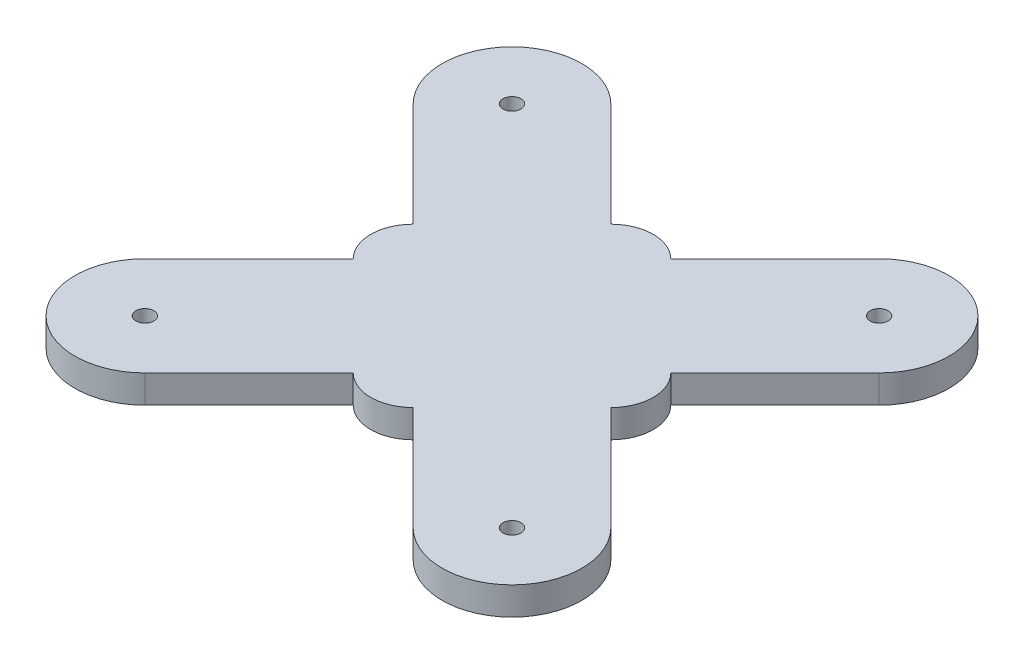
ISO-10303-21;
HEADER;
FILE_DESCRIPTION(('STEP AP214'),'2;1');
FILE_NAME('part.step','',(''),(''),'','','');
FILE_SCHEMA(('AUTOMOTIVE_DESIGN { 1 0 10303 214 1 1 1 1 }'));
ENDSEC;
DATA;
#1=APPLICATION_CONTEXT('core data for automotive mechanical design processes');
#2=APPLICATION_PROTOCOL_DEFINITION('international standard','automotive_design',2000,#1);
#3=PRODUCT_CONTEXT('',#1,'mechanical');
#4=PRODUCT('Part','Part','',(#3));
#5=PRODUCT_RELATED_PRODUCT_CATEGORY('part','',(#4));
#6=PRODUCT_DEFINITION_FORMATION('','',#4);
#7=PRODUCT_DEFINITION_CONTEXT('part definition',#1,'design');
#8=PRODUCT_DEFINITION('design','',#6,#7);
#9=PRODUCT_DEFINITION_SHAPE('','',#8);
#10=(LENGTH_UNIT() NAMED_UNIT(*) SI_UNIT(.MILLI.,.METRE.));
#11=(NAMED_UNIT(*) PLANE_ANGLE_UNIT() SI_UNIT($,.RADIAN.));
#12=(NAMED_UNIT(*) SI_UNIT($,.STERADIAN.) SOLID_ANGLE_UNIT());
#13=UNCERTAINTY_MEASURE_WITH_UNIT(LENGTH_MEASURE(1.E-05),#10,'distance_accuracy_value','');
#14=(GEOMETRIC_REPRESENTATION_CONTEXT(3) GLOBAL_UNCERTAINTY_ASSIGNED_CONTEXT((#13)) GLOBAL_UNIT_ASSIGNED_CONTEXT((#10,
#11,#12)) REPRESENTATION_CONTEXT('',''));
#15=CARTESIAN_POINT('',(0.,0.,0.));
#16=DIRECTION('',(0.,0.,1.));
#17=DIRECTION('',(1.,0.,0.));
#18=AXIS2_PLACEMENT_3D('',#15,#16,#17);
#19=CARTESIAN_POINT('',(-65.654864633171,10.,-65.654864633171));
#20=DIRECTION('',(0.,1.,0.));
#21=DIRECTION('',(0.,0.,1.));
#22=AXIS2_PLACEMENT_3D('',#19,#20,#21);
#23=PLANE('',#22);
#24=CARTESIAN_POINT('',(65.654864633171,10.,-65.654864633171));
#25=DIRECTION('',(0.,1.,0.));
#26=DIRECTION('',(0.,0.,1.));
#27=AXIS2_PLACEMENT_3D('',#24,#25,#26);
#28=CIRCLE('',#27,3.19999999999999);
#29=CARTESIAN_POINT('',(65.654864633171,10.,-62.454864633171));
#30=VERTEX_POINT('',#29);
#31=EDGE_CURVE('E344',#30,#30,#28,.T.);
#32=ORIENTED_EDGE('',*,*,#31,.F.);
#33=EDGE_LOOP('',(#32));
#34=FACE_BOUND('',#33,.T.);
#35=CARTESIAN_POINT('',(-65.654864633171,10.,-65.654864633171));
#36=DIRECTION('',(0.,1.,0.));
#37=DIRECTION('',(0.,0.,1.));
#38=AXIS2_PLACEMENT_3D('',#35,#36,#37);
#39=CIRCLE('',#38,3.19999999999999);
#40=CARTESIAN_POINT('',(-65.654864633171,10.,-62.454864633171));
#41=VERTEX_POINT('',#40);
#42=EDGE_CURVE('E182',#41,#41,#39,.T.);
#43=ORIENTED_EDGE('',*,*,#42,.F.);
#44=EDGE_LOOP('',(#43));
#45=FACE_BOUND('',#44,.T.);
#46=CARTESIAN_POINT('',(-65.654864633171,10.,-65.654864633171));
#47=DIRECTION('',(0.,1.,0.));
#48=DIRECTION('',(0.,0.,1.));
#49=AXIS2_PLACEMENT_3D('',#46,#47,#48);
#50=CIRCLE('',#49,25.);
#51=CARTESIAN_POINT('',(-47.9771951035073,10.,-83.3325341628346));
#52=VERTEX_POINT('',#51);
#53=CARTESIAN_POINT('',(-83.3325341628346,10.,-47.9771951035073));
#54=VERTEX_POINT('',#53);
#55=EDGE_CURVE('E209',#52,#54,#50,.T.);
#56=ORIENTED_EDGE('',*,*,#55,.T.);
#57=DIRECTION('',(0.707106781186547,0.,0.707106781186548));
#58=VECTOR('',#57,1.);
#59=CARTESIAN_POINT('',(-83.3325341628346,10.,-47.9771951035073));
#60=LINE('',#59,#58);
#61=CARTESIAN_POINT('',(-46.0745224218814,10.,-10.7191833625541));
#62=VERTEX_POINT('',#61);
#63=EDGE_CURVE('E117',#54,#62,#60,.T.);
#64=ORIENTED_EDGE('',*,*,#63,.T.);
#65=CARTESIAN_POINT('',(-35.3553390593273,10.,0.));
#66=DIRECTION('',(0.,1.,0.));
#67=DIRECTION('',(0.,0.,1.));
#68=AXIS2_PLACEMENT_3D('',#65,#66,#67);
#69=CIRCLE('',#68,15.159214488888);
#70=CARTESIAN_POINT('',(-46.0745224218814,10.,10.7191833625541));
#71=VERTEX_POINT('',#70);
#72=EDGE_CURVE('E248',#62,#71,#69,.T.);
#73=ORIENTED_EDGE('',*,*,#72,.T.);
#74=DIRECTION('',(-0.707106781186547,0.,0.707106781186547));
#75=VECTOR('',#74,1.);
#76=CARTESIAN_POINT('',(-83.3325341628347,10.,47.9771951035073));
#77=LINE('',#76,#75);
#78=CARTESIAN_POINT('',(-83.3325341628347,10.,47.9771951035073));
#79=VERTEX_POINT('',#78);
#80=EDGE_CURVE('E267',#71,#79,#77,.T.);
#81=ORIENTED_EDGE('',*,*,#80,.T.);
#82=CARTESIAN_POINT('',(-65.654864633171,10.,65.654864633171));
#83=DIRECTION('',(0.,1.,0.));
#84=DIRECTION('',(0.,0.,1.));
#85=AXIS2_PLACEMENT_3D('',#82,#83,#84);
#86=CIRCLE('',#85,25.);
#87=CARTESIAN_POINT('',(-47.9771951035073,10.,83.3325341628347));
#88=VERTEX_POINT('',#87);
#89=EDGE_CURVE('E264',#79,#88,#86,.T.);
#90=ORIENTED_EDGE('',*,*,#89,.T.);
#91=DIRECTION('',(0.707106781186548,0.,-0.707106781186547));
#92=VECTOR('',#91,1.);
#93=CARTESIAN_POINT('',(-47.9771951035073,10.,83.3325341628347));
#94=LINE('',#93,#92);
#95=CARTESIAN_POINT('',(-10.719183362554,10.,46.0745224218814));
#96=VERTEX_POINT('',#95);
#97=EDGE_CURVE('E266',#88,#96,#94,.T.);
#98=ORIENTED_EDGE('',*,*,#97,.T.);
#99=CARTESIAN_POINT('',(0.,10.,35.3553390593274));
#100=DIRECTION('',(0.,1.,0.));
#101=DIRECTION('',(0.,0.,1.));
#102=AXIS2_PLACEMENT_3D('',#99,#100,#101);
#103=CIRCLE('',#102,15.159214488888);
#104=CARTESIAN_POINT('',(10.7191833625541,10.,46.0745224218814));
#105=VERTEX_POINT('',#104);
#106=EDGE_CURVE('E269',#96,#105,#103,.T.);
#107=ORIENTED_EDGE('',*,*,#106,.T.);
#108=DIRECTION('',(0.707106781186548,0.,0.707106781186547));
#109=VECTOR('',#108,1.);
#110=CARTESIAN_POINT('',(10.7191833625541,10.,46.0745224218814));
#111=LINE('',#110,#109);
#112=CARTESIAN_POINT('',(47.9771951035073,10.,83.3325341628346));
#113=VERTEX_POINT('',#112);
#114=EDGE_CURVE('E275',#105,#113,#111,.T.);
#115=ORIENTED_EDGE('',*,*,#114,.T.);
#116=CARTESIAN_POINT('',(65.654864633171,10.,65.654864633171));
#117=DIRECTION('',(0.,1.,0.));
#118=DIRECTION('',(0.,0.,1.));
#119=AXIS2_PLACEMENT_3D('',#116,#117,#118);
#120=CIRCLE('',#119,25.);
#121=CARTESIAN_POINT('',(83.3325341628346,10.,47.9771951035073));
#122=VERTEX_POINT('',#121);
#123=EDGE_CURVE('E277',#113,#122,#120,.T.);
#124=ORIENTED_EDGE('',*,*,#123,.T.);
#125=DIRECTION('',(-0.707106781186547,0.,-0.707106781186548));
#126=VECTOR('',#125,1.);
#127=CARTESIAN_POINT('',(46.0745224218814,10.,10.719183362554));
#128=LINE('',#127,#126);
#129=CARTESIAN_POINT('',(46.0745224218814,10.,10.719183362554));
#130=VERTEX_POINT('',#129);
#131=EDGE_CURVE('E279',#122,#130,#128,.T.);
#132=ORIENTED_EDGE('',*,*,#131,.T.);
#133=CARTESIAN_POINT('',(35.3553390593274,10.,0.));
#134=DIRECTION('',(0.,1.,0.));
#135=DIRECTION('',(0.,0.,1.));
#136=AXIS2_PLACEMENT_3D('',#133,#134,#135);
#137=CIRCLE('',#136,15.159214488888);
#138=CARTESIAN_POINT('',(46.0745224218814,10.,-10.719183362554));
#139=VERTEX_POINT('',#138);
#140=EDGE_CURVE('E281',#130,#139,#137,.T.);
#141=ORIENTED_EDGE('',*,*,#140,.T.);
#142=DIRECTION('',(0.707106781186548,0.,-0.707106781186547));
#143=VECTOR('',#142,1.);
#144=CARTESIAN_POINT('',(46.0745224218814,10.,-10.719183362554));
#145=LINE('',#144,#143);
#146=CARTESIAN_POINT('',(83.3325341628347,10.,-47.9771951035073));
#147=VERTEX_POINT('',#146);
#148=EDGE_CURVE('E283',#139,#147,#145,.T.);
#149=ORIENTED_EDGE('',*,*,#148,.T.);
#150=CARTESIAN_POINT('',(65.654864633171,10.,-65.654864633171));
#151=DIRECTION('',(0.,1.,0.));
#152=DIRECTION('',(0.,0.,1.));
#153=AXIS2_PLACEMENT_3D('',#150,#151,#152);
#154=CIRCLE('',#153,25.);
#155=CARTESIAN_POINT('',(47.9771951035073,10.,-83.3325341628347));
#156=VERTEX_POINT('',#155);
#157=EDGE_CURVE('E160',#147,#156,#154,.T.);
#158=ORIENTED_EDGE('',*,*,#157,.T.);
#159=DIRECTION('',(-0.707106781186548,0.,0.707106781186547));
#160=VECTOR('',#159,1.);
#161=CARTESIAN_POINT('',(10.719183362554,10.,-46.0745224218814));
#162=LINE('',#161,#160);
#163=CARTESIAN_POINT('',(10.719183362554,10.,-46.0745224218814));
#164=VERTEX_POINT('',#163);
#165=EDGE_CURVE('E154',#156,#164,#162,.T.);
#166=ORIENTED_EDGE('',*,*,#165,.T.);
#167=CARTESIAN_POINT('',(0.,10.,-35.3553390593274));
#168=DIRECTION('',(0.,1.,0.));
#169=DIRECTION('',(0.,0.,1.));
#170=AXIS2_PLACEMENT_3D('',#167,#168,#169);
#171=CIRCLE('',#170,15.159214488888);
#172=CARTESIAN_POINT('',(-10.7191833625541,10.,-46.0745224218814));
#173=VERTEX_POINT('',#172);
#174=EDGE_CURVE('E158',#164,#173,#171,.T.);
#175=ORIENTED_EDGE('',*,*,#174,.T.);
#176=DIRECTION('',(-0.707106781186548,0.,-0.707106781186547));
#177=VECTOR('',#176,1.);
#178=CARTESIAN_POINT('',(-47.9771951035073,10.,-83.3325341628346));
#179=LINE('',#178,#177);
#180=EDGE_CURVE('E50',#173,#52,#179,.T.);
#181=ORIENTED_EDGE('',*,*,#180,.T.);
#182=EDGE_LOOP('',(#56,#64,#73,#81,#90,#98,#107,#115,#124,#132,#141,#149,#158,#166,#175,#181));
#183=FACE_BOUND('',#182,.T.);
#184=CARTESIAN_POINT('',(65.654864633171,10.,65.654864633171));
#185=DIRECTION('',(0.,1.,0.));
#186=DIRECTION('',(0.,0.,-1.));
#187=AXIS2_PLACEMENT_3D('',#184,#185,#186);
#188=CIRCLE('',#187,3.19999999999999);
#189=CARTESIAN_POINT('',(65.654864633171,10.,62.454864633171));
#190=VERTEX_POINT('',#189);
#191=EDGE_CURVE('E350',#190,#190,#188,.T.);
#192=ORIENTED_EDGE('',*,*,#191,.F.);
#193=EDGE_LOOP('',(#192));
#194=FACE_BOUND('',#193,.T.);
#195=CARTESIAN_POINT('',(-65.654864633171,10.,65.654864633171));
#196=DIRECTION('',(0.,1.,0.));
#197=DIRECTION('',(0.,0.,-1.));
#198=AXIS2_PLACEMENT_3D('',#195,#196,#197);
#199=CIRCLE('',#198,3.19999999999992);
#200=CARTESIAN_POINT('',(-65.654864633171,10.,62.4548646331711));
#201=VERTEX_POINT('',#200);
#202=EDGE_CURVE('E335',#201,#201,#199,.T.);
#203=ORIENTED_EDGE('',*,*,#202,.F.);
#204=EDGE_LOOP('',(#203));
#205=FACE_BOUND('',#204,.T.);
#206=ADVANCED_FACE('F33',(#34,#45,#183,#194,#205),#23,.T.);
#207=CARTESIAN_POINT('',(-65.654864633171,0.,-65.654864633171));
#208=DIRECTION('',(0.,1.,0.));
#209=DIRECTION('',(0.,0.,1.));
#210=AXIS2_PLACEMENT_3D('',#207,#208,#209);
#211=PLANE('',#210);
#212=CARTESIAN_POINT('',(65.654864633171,0.,-65.654864633171));
#213=DIRECTION('',(0.,1.,0.));
#214=DIRECTION('',(0.,0.,1.));
#215=AXIS2_PLACEMENT_3D('',#212,#213,#214);
#216=CIRCLE('',#215,3.19999999999999);
#217=CARTESIAN_POINT('',(65.654864633171,0.,-62.454864633171));
#218=VERTEX_POINT('',#217);
#219=EDGE_CURVE('E341',#218,#218,#216,.T.);
#220=ORIENTED_EDGE('',*,*,#219,.T.);
#221=EDGE_LOOP('',(#220));
#222=FACE_BOUND('',#221,.T.);
#223=CARTESIAN_POINT('',(-65.654864633171,0.,-65.654864633171));
#224=DIRECTION('',(0.,1.,0.));
#225=DIRECTION('',(0.,0.,1.));
#226=AXIS2_PLACEMENT_3D('',#223,#224,#225);
#227=CIRCLE('',#226,3.19999999999999);
#228=CARTESIAN_POINT('',(-65.654864633171,0.,-62.454864633171));
#229=VERTEX_POINT('',#228);
#230=EDGE_CURVE('E353',#229,#229,#227,.T.);
#231=ORIENTED_EDGE('',*,*,#230,.T.);
#232=EDGE_LOOP('',(#231));
#233=FACE_BOUND('',#232,.T.);
#234=CARTESIAN_POINT('',(-65.654864633171,0.,-65.654864633171));
#235=DIRECTION('',(0.,1.,0.));
#236=DIRECTION('',(0.,0.,1.));
#237=AXIS2_PLACEMENT_3D('',#234,#235,#236);
#238=CIRCLE('',#237,25.);
#239=CARTESIAN_POINT('',(-47.9771951035073,0.,-83.3325341628346));
#240=VERTEX_POINT('',#239);
#241=CARTESIAN_POINT('',(-83.3325341628346,0.,-47.9771951035073));
#242=VERTEX_POINT('',#241);
#243=EDGE_CURVE('E178',#240,#242,#238,.T.);
#244=ORIENTED_EDGE('',*,*,#243,.F.);
#245=DIRECTION('',(-0.707106781186548,0.,-0.707106781186547));
#246=VECTOR('',#245,1.);
#247=CARTESIAN_POINT('',(-47.9771951035073,0.,-83.3325341628346));
#248=LINE('',#247,#246);
#249=CARTESIAN_POINT('',(-10.7191833625541,0.,-46.0745224218814));
#250=VERTEX_POINT('',#249);
#251=EDGE_CURVE('E109',#250,#240,#248,.T.);
#252=ORIENTED_EDGE('',*,*,#251,.F.);
#253=CARTESIAN_POINT('',(0.,0.,-35.3553390593274));
#254=DIRECTION('',(0.,1.,0.));
#255=DIRECTION('',(0.,0.,1.));
#256=AXIS2_PLACEMENT_3D('',#253,#254,#255);
#257=CIRCLE('',#256,15.159214488888);
#258=CARTESIAN_POINT('',(10.719183362554,0.,-46.0745224218814));
#259=VERTEX_POINT('',#258);
#260=EDGE_CURVE('E103',#259,#250,#257,.T.);
#261=ORIENTED_EDGE('',*,*,#260,.F.);
#262=DIRECTION('',(-0.707106781186548,0.,0.707106781186547));
#263=VECTOR('',#262,1.);
#264=CARTESIAN_POINT('',(10.719183362554,0.,-46.0745224218814));
#265=LINE('',#264,#263);
#266=CARTESIAN_POINT('',(47.9771951035073,0.,-83.3325341628347));
#267=VERTEX_POINT('',#266);
#268=EDGE_CURVE('E168',#267,#259,#265,.T.);
#269=ORIENTED_EDGE('',*,*,#268,.F.);
#270=CARTESIAN_POINT('',(65.654864633171,0.,-65.654864633171));
#271=DIRECTION('',(0.,1.,0.));
#272=DIRECTION('',(0.,0.,1.));
#273=AXIS2_PLACEMENT_3D('',#270,#271,#272);
#274=CIRCLE('',#273,25.);
#275=CARTESIAN_POINT('',(83.3325341628347,0.,-47.9771951035073));
#276=VERTEX_POINT('',#275);
#277=EDGE_CURVE('E204',#276,#267,#274,.T.);
#278=ORIENTED_EDGE('',*,*,#277,.F.);
#279=DIRECTION('',(0.707106781186548,0.,-0.707106781186547));
#280=VECTOR('',#279,1.);
#281=CARTESIAN_POINT('',(46.0745224218814,0.,-10.719183362554));
#282=LINE('',#281,#280);
#283=CARTESIAN_POINT('',(46.0745224218814,0.,-10.719183362554));
#284=VERTEX_POINT('',#283);
#285=EDGE_CURVE('E202',#284,#276,#282,.T.);
#286=ORIENTED_EDGE('',*,*,#285,.F.);
#287=CARTESIAN_POINT('',(35.3553390593274,0.,0.));
#288=DIRECTION('',(0.,1.,0.));
#289=DIRECTION('',(0.,0.,1.));
#290=AXIS2_PLACEMENT_3D('',#287,#288,#289);
#291=CIRCLE('',#290,15.159214488888);
#292=CARTESIAN_POINT('',(46.0745224218814,0.,10.719183362554));
#293=VERTEX_POINT('',#292);
#294=EDGE_CURVE('E200',#293,#284,#291,.T.);
#295=ORIENTED_EDGE('',*,*,#294,.F.);
#296=DIRECTION('',(-0.707106781186547,0.,-0.707106781186548));
#297=VECTOR('',#296,1.);
#298=CARTESIAN_POINT('',(46.0745224218814,0.,10.719183362554));
#299=LINE('',#298,#297);
#300=CARTESIAN_POINT('',(83.3325341628346,0.,47.9771951035073));
#301=VERTEX_POINT('',#300);
#302=EDGE_CURVE('E198',#301,#293,#299,.T.);
#303=ORIENTED_EDGE('',*,*,#302,.F.);
#304=CARTESIAN_POINT('',(65.654864633171,0.,65.654864633171));
#305=DIRECTION('',(0.,1.,0.));
#306=DIRECTION('',(0.,0.,1.));
#307=AXIS2_PLACEMENT_3D('',#304,#305,#306);
#308=CIRCLE('',#307,25.);
#309=CARTESIAN_POINT('',(47.9771951035073,0.,83.3325341628346));
#310=VERTEX_POINT('',#309);
#311=EDGE_CURVE('E196',#310,#301,#308,.T.);
#312=ORIENTED_EDGE('',*,*,#311,.F.);
#313=DIRECTION('',(0.707106781186548,0.,0.707106781186547));
#314=VECTOR('',#313,1.);
#315=CARTESIAN_POINT('',(10.7191833625541,0.,46.0745224218814));
#316=LINE('',#315,#314);
#317=CARTESIAN_POINT('',(10.7191833625541,0.,46.0745224218814));
#318=VERTEX_POINT('',#317);
#319=EDGE_CURVE('E194',#318,#310,#316,.T.);
#320=ORIENTED_EDGE('',*,*,#319,.F.);
#321=CARTESIAN_POINT('',(0.,0.,35.3553390593274));
#322=DIRECTION('',(0.,1.,0.));
#323=DIRECTION('',(0.,0.,1.));
#324=AXIS2_PLACEMENT_3D('',#321,#322,#323);
#325=CIRCLE('',#324,15.159214488888);
#326=CARTESIAN_POINT('',(-10.719183362554,0.,46.0745224218814));
#327=VERTEX_POINT('',#326);
#328=EDGE_CURVE('E192',#327,#318,#325,.T.);
#329=ORIENTED_EDGE('',*,*,#328,.F.);
#330=DIRECTION('',(0.707106781186548,0.,-0.707106781186547));
#331=VECTOR('',#330,1.);
#332=CARTESIAN_POINT('',(-47.9771951035073,0.,83.3325341628347));
#333=LINE('',#332,#331);
#334=CARTESIAN_POINT('',(-47.9771951035073,0.,83.3325341628347));
#335=VERTEX_POINT('',#334);
#336=EDGE_CURVE('E190',#335,#327,#333,.T.);
#337=ORIENTED_EDGE('',*,*,#336,.F.);
#338=CARTESIAN_POINT('',(-65.654864633171,0.,65.654864633171));
#339=DIRECTION('',(0.,1.,0.));
#340=DIRECTION('',(0.,0.,1.));
#341=AXIS2_PLACEMENT_3D('',#338,#339,#340);
#342=CIRCLE('',#341,25.);
#343=CARTESIAN_POINT('',(-83.3325341628347,0.,47.9771951035073));
#344=VERTEX_POINT('',#343);
#345=EDGE_CURVE('E188',#344,#335,#342,.T.);
#346=ORIENTED_EDGE('',*,*,#345,.F.);
#347=DIRECTION('',(-0.707106781186547,0.,0.707106781186547));
#348=VECTOR('',#347,1.);
#349=CARTESIAN_POINT('',(-83.3325341628347,0.,47.9771951035073));
#350=LINE('',#349,#348);
#351=CARTESIAN_POINT('',(-46.0745224218814,0.,10.7191833625541));
#352=VERTEX_POINT('',#351);
#353=EDGE_CURVE('E186',#352,#344,#350,.T.);
#354=ORIENTED_EDGE('',*,*,#353,.F.);
#355=CARTESIAN_POINT('',(-35.3553390593273,0.,0.));
#356=DIRECTION('',(0.,1.,0.));
#357=DIRECTION('',(0.,0.,1.));
#358=AXIS2_PLACEMENT_3D('',#355,#356,#357);
#359=CIRCLE('',#358,15.159214488888);
#360=CARTESIAN_POINT('',(-46.0745224218814,0.,-10.7191833625541));
#361=VERTEX_POINT('',#360);
#362=EDGE_CURVE('E184',#361,#352,#359,.T.);
#363=ORIENTED_EDGE('',*,*,#362,.F.);
#364=DIRECTION('',(0.707106781186547,0.,0.707106781186548));
#365=VECTOR('',#364,1.);
#366=CARTESIAN_POINT('',(-83.3325341628346,0.,-47.9771951035073));
#367=LINE('',#366,#365);
#368=EDGE_CURVE('E181',#242,#361,#367,.T.);
#369=ORIENTED_EDGE('',*,*,#368,.F.);
#370=EDGE_LOOP('',(#244,#252,#261,#269,#278,#286,#295,#303,#312,#320,#329,#337,#346,#354,#363,#369));
#371=FACE_BOUND('',#370,.T.);
#372=CARTESIAN_POINT('',(65.654864633171,0.,65.654864633171));
#373=DIRECTION('',(0.,1.,0.));
#374=DIRECTION('',(0.,0.,-1.));
#375=AXIS2_PLACEMENT_3D('',#372,#373,#374);
#376=CIRCLE('',#375,3.19999999999999);
#377=CARTESIAN_POINT('',(65.654864633171,0.,62.454864633171));
#378=VERTEX_POINT('',#377);
#379=EDGE_CURVE('E347',#378,#378,#376,.T.);
#380=ORIENTED_EDGE('',*,*,#379,.T.);
#381=EDGE_LOOP('',(#380));
#382=FACE_BOUND('',#381,.T.);
#383=CARTESIAN_POINT('',(-65.654864633171,0.,65.654864633171));
#384=DIRECTION('',(0.,1.,0.));
#385=DIRECTION('',(0.,0.,-1.));
#386=AXIS2_PLACEMENT_3D('',#383,#384,#385);
#387=CIRCLE('',#386,3.19999999999992);
#388=CARTESIAN_POINT('',(-65.654864633171,0.,62.4548646331711));
#389=VERTEX_POINT('',#388);
#390=EDGE_CURVE('E338',#389,#389,#387,.T.);
#391=ORIENTED_EDGE('',*,*,#390,.T.);
#392=EDGE_LOOP('',(#391));
#393=FACE_BOUND('',#392,.T.);
#394=ADVANCED_FACE('F252',(#222,#233,#371,#382,#393),#211,.F.);
#395=CARTESIAN_POINT('',(-65.654864633171,10.,-65.654864633171));
#396=DIRECTION('',(0.,-1.,0.));
#397=DIRECTION('',(0.,0.,-1.));
#398=AXIS2_PLACEMENT_3D('',#395,#396,#397);
#399=CYLINDRICAL_SURFACE('',#398,25.);
#400=ORIENTED_EDGE('',*,*,#243,.T.);
#401=DIRECTION('',(0.,-1.,0.));
#402=VECTOR('',#401,1.);
#403=CARTESIAN_POINT('',(-83.3325341628346,10.,-47.9771951035073));
#404=LINE('',#403,#402);
#405=EDGE_CURVE('E11',#54,#242,#404,.T.);
#406=ORIENTED_EDGE('',*,*,#405,.F.);
#407=ORIENTED_EDGE('',*,*,#55,.F.);
#408=DIRECTION('',(0.,-1.,0.));
#409=VECTOR('',#408,1.);
#410=CARTESIAN_POINT('',(-47.9771951035073,10.,-83.3325341628346));
#411=LINE('',#410,#409);
#412=EDGE_CURVE('E174',#52,#240,#411,.T.);
#413=ORIENTED_EDGE('',*,*,#412,.T.);
#414=EDGE_LOOP('',(#400,#406,#407,#413));
#415=FACE_BOUND('',#414,.T.);
#416=ADVANCED_FACE('F35',(#415),#399,.T.);
#417=CARTESIAN_POINT('',(-83.3325341628346,10.,-47.9771951035073));
#418=DIRECTION('',(0.707106781186548,0.,-0.707106781186547));
#419=DIRECTION('',(-0.707106781186547,0.,-0.707106781186548));
#420=AXIS2_PLACEMENT_3D('',#417,#418,#419);
#421=PLANE('',#420);
#422=ORIENTED_EDGE('',*,*,#368,.T.);
#423=DIRECTION('',(0.,-1.,0.));
#424=VECTOR('',#423,1.);
#425=CARTESIAN_POINT('',(-46.0745224218814,10.,-10.7191833625541));
#426=LINE('',#425,#424);
#427=EDGE_CURVE('E42',#62,#361,#426,.T.);
#428=ORIENTED_EDGE('',*,*,#427,.F.);
#429=ORIENTED_EDGE('',*,*,#63,.F.);
#430=ORIENTED_EDGE('',*,*,#405,.T.);
#431=EDGE_LOOP('',(#422,#428,#429,#430));
#432=FACE_BOUND('',#431,.T.);
#433=ADVANCED_FACE('F502',(#432),#421,.F.);
#434=CARTESIAN_POINT('',(-35.3553390593273,10.,0.));
#435=DIRECTION('',(0.,-1.,0.));
#436=DIRECTION('',(0.,0.,-1.));
#437=AXIS2_PLACEMENT_3D('',#434,#435,#436);
#438=CYLINDRICAL_SURFACE('',#437,15.159214488888);
#439=ORIENTED_EDGE('',*,*,#362,.T.);
#440=DIRECTION('',(0.,-1.,0.));
#441=VECTOR('',#440,1.);
#442=CARTESIAN_POINT('',(-46.0745224218814,10.,10.7191833625541));
#443=LINE('',#442,#441);
#444=EDGE_CURVE('E240',#71,#352,#443,.T.);
#445=ORIENTED_EDGE('',*,*,#444,.F.);
#446=ORIENTED_EDGE('',*,*,#72,.F.);
#447=ORIENTED_EDGE('',*,*,#427,.T.);
#448=EDGE_LOOP('',(#439,#445,#446,#447));
#449=FACE_BOUND('',#448,.T.);
#450=ADVANCED_FACE('F246',(#449),#438,.T.);
#451=CARTESIAN_POINT('',(-83.3325341628347,10.,47.9771951035073));
#452=DIRECTION('',(0.707106781186548,0.,0.707106781186548));
#453=DIRECTION('',(0.707106781186548,0.,-0.707106781186548));
#454=AXIS2_PLACEMENT_3D('',#451,#452,#453);
#455=PLANE('',#454);
#456=ORIENTED_EDGE('',*,*,#353,.T.);
#457=DIRECTION('',(0.,-1.,0.));
#458=VECTOR('',#457,1.);
#459=CARTESIAN_POINT('',(-83.3325341628347,10.,47.9771951035073));
#460=LINE('',#459,#458);
#461=EDGE_CURVE('E237',#79,#344,#460,.T.);
#462=ORIENTED_EDGE('',*,*,#461,.F.);
#463=ORIENTED_EDGE('',*,*,#80,.F.);
#464=ORIENTED_EDGE('',*,*,#444,.T.);
#465=EDGE_LOOP('',(#456,#462,#463,#464));
#466=FACE_BOUND('',#465,.T.);
#467=ADVANCED_FACE('F258',(#466),#455,.F.);
#468=CARTESIAN_POINT('',(-65.654864633171,10.,65.654864633171));
#469=DIRECTION('',(0.,-1.,0.));
#470=DIRECTION('',(0.,0.,-1.));
#471=AXIS2_PLACEMENT_3D('',#468,#469,#470);
#472=CYLINDRICAL_SURFACE('',#471,25.);
#473=ORIENTED_EDGE('',*,*,#345,.T.);
#474=DIRECTION('',(0.,-1.,0.));
#475=VECTOR('',#474,1.);
#476=CARTESIAN_POINT('',(-47.9771951035073,10.,83.3325341628347));
#477=LINE('',#476,#475);
#478=EDGE_CURVE('E234',#88,#335,#477,.T.);
#479=ORIENTED_EDGE('',*,*,#478,.F.);
#480=ORIENTED_EDGE('',*,*,#89,.F.);
#481=ORIENTED_EDGE('',*,*,#461,.T.);
#482=EDGE_LOOP('',(#473,#479,#480,#481));
#483=FACE_BOUND('',#482,.T.);
#484=ADVANCED_FACE('F262',(#483),#472,.T.);
#485=CARTESIAN_POINT('',(-47.9771951035073,10.,83.3325341628347));
#486=DIRECTION('',(-0.707106781186547,0.,-0.707106781186548));
#487=DIRECTION('',(-0.707106781186548,0.,0.707106781186547));
#488=AXIS2_PLACEMENT_3D('',#485,#486,#487);
#489=PLANE('',#488);
#490=ORIENTED_EDGE('',*,*,#336,.T.);
#491=DIRECTION('',(0.,-1.,0.));
#492=VECTOR('',#491,1.);
#493=CARTESIAN_POINT('',(-10.719183362554,10.,46.0745224218814));
#494=LINE('',#493,#492);
#495=EDGE_CURVE('E231',#96,#327,#494,.T.);
#496=ORIENTED_EDGE('',*,*,#495,.F.);
#497=ORIENTED_EDGE('',*,*,#97,.F.);
#498=ORIENTED_EDGE('',*,*,#478,.T.);
#499=EDGE_LOOP('',(#490,#496,#497,#498));
#500=FACE_BOUND('',#499,.T.);
#501=ADVANCED_FACE('F467',(#500),#489,.F.);
#502=CARTESIAN_POINT('',(0.,10.,35.3553390593274));
#503=DIRECTION('',(0.,-1.,0.));
#504=DIRECTION('',(0.,0.,-1.));
#505=AXIS2_PLACEMENT_3D('',#502,#503,#504);
#506=CYLINDRICAL_SURFACE('',#505,15.159214488888);
#507=ORIENTED_EDGE('',*,*,#328,.T.);
#508=DIRECTION('',(0.,-1.,0.));
#509=VECTOR('',#508,1.);
#510=CARTESIAN_POINT('',(10.7191833625541,10.,46.0745224218814));
#511=LINE('',#510,#509);
#512=EDGE_CURVE('E228',#105,#318,#511,.T.);
#513=ORIENTED_EDGE('',*,*,#512,.F.);
#514=ORIENTED_EDGE('',*,*,#106,.F.);
#515=ORIENTED_EDGE('',*,*,#495,.T.);
#516=EDGE_LOOP('',(#507,#513,#514,#515));
#517=FACE_BOUND('',#516,.T.);
#518=ADVANCED_FACE('F457',(#517),#506,.T.);
#519=CARTESIAN_POINT('',(10.7191833625541,10.,46.0745224218814));
#520=DIRECTION('',(0.707106781186547,0.,-0.707106781186548));
#521=DIRECTION('',(-0.707106781186548,0.,-0.707106781186547));
#522=AXIS2_PLACEMENT_3D('',#519,#520,#521);
#523=PLANE('',#522);
#524=ORIENTED_EDGE('',*,*,#319,.T.);
#525=DIRECTION('',(0.,-1.,0.));
#526=VECTOR('',#525,1.);
#527=CARTESIAN_POINT('',(47.9771951035073,10.,83.3325341628346));
#528=LINE('',#527,#526);
#529=EDGE_CURVE('E225',#113,#310,#528,.T.);
#530=ORIENTED_EDGE('',*,*,#529,.F.);
#531=ORIENTED_EDGE('',*,*,#114,.F.);
#532=ORIENTED_EDGE('',*,*,#512,.T.);
#533=EDGE_LOOP('',(#524,#530,#531,#532));
#534=FACE_BOUND('',#533,.T.);
#535=ADVANCED_FACE('F447',(#534),#523,.F.);
#536=CARTESIAN_POINT('',(65.654864633171,10.,65.654864633171));
#537=DIRECTION('',(0.,-1.,0.));
#538=DIRECTION('',(0.,0.,-1.));
#539=AXIS2_PLACEMENT_3D('',#536,#537,#538);
#540=CYLINDRICAL_SURFACE('',#539,25.);
#541=ORIENTED_EDGE('',*,*,#311,.T.);
#542=DIRECTION('',(0.,-1.,0.));
#543=VECTOR('',#542,1.);
#544=CARTESIAN_POINT('',(83.3325341628346,10.,47.9771951035073));
#545=LINE('',#544,#543);
#546=EDGE_CURVE('E222',#122,#301,#545,.T.);
#547=ORIENTED_EDGE('',*,*,#546,.F.);
#548=ORIENTED_EDGE('',*,*,#123,.F.);
#549=ORIENTED_EDGE('',*,*,#529,.T.);
#550=EDGE_LOOP('',(#541,#547,#548,#549));
#551=FACE_BOUND('',#550,.T.);
#552=ADVANCED_FACE('F437',(#551),#540,.T.);
#553=CARTESIAN_POINT('',(46.0745224218814,10.,10.719183362554));
#554=DIRECTION('',(-0.707106781186548,0.,0.707106781186547));
#555=DIRECTION('',(0.707106781186547,0.,0.707106781186548));
#556=AXIS2_PLACEMENT_3D('',#553,#554,#555);
#557=PLANE('',#556);
#558=ORIENTED_EDGE('',*,*,#302,.T.);
#559=DIRECTION('',(0.,-1.,0.));
#560=VECTOR('',#559,1.);
#561=CARTESIAN_POINT('',(46.0745224218814,10.,10.719183362554));
#562=LINE('',#561,#560);
#563=EDGE_CURVE('E219',#130,#293,#562,.T.);
#564=ORIENTED_EDGE('',*,*,#563,.F.);
#565=ORIENTED_EDGE('',*,*,#131,.F.);
#566=ORIENTED_EDGE('',*,*,#546,.T.);
#567=EDGE_LOOP('',(#558,#564,#565,#566));
#568=FACE_BOUND('',#567,.T.);
#569=ADVANCED_FACE('F427',(#568),#557,.F.);
#570=CARTESIAN_POINT('',(35.3553390593274,10.,0.));
#571=DIRECTION('',(0.,-1.,0.));
#572=DIRECTION('',(0.,0.,-1.));
#573=AXIS2_PLACEMENT_3D('',#570,#571,#572);
#574=CYLINDRICAL_SURFACE('',#573,15.159214488888);
#575=ORIENTED_EDGE('',*,*,#294,.T.);
#576=DIRECTION('',(0.,-1.,0.));
#577=VECTOR('',#576,1.);
#578=CARTESIAN_POINT('',(46.0745224218814,10.,-10.719183362554));
#579=LINE('',#578,#577);
#580=EDGE_CURVE('E216',#139,#284,#579,.T.);
#581=ORIENTED_EDGE('',*,*,#580,.F.);
#582=ORIENTED_EDGE('',*,*,#140,.F.);
#583=ORIENTED_EDGE('',*,*,#563,.T.);
#584=EDGE_LOOP('',(#575,#581,#582,#583));
#585=FACE_BOUND('',#584,.T.);
#586=ADVANCED_FACE('F418',(#585),#574,.T.);
#587=CARTESIAN_POINT('',(46.0745224218814,10.,-10.719183362554));
#588=DIRECTION('',(-0.707106781186547,0.,-0.707106781186548));
#589=DIRECTION('',(-0.707106781186548,0.,0.707106781186547));
#590=AXIS2_PLACEMENT_3D('',#587,#588,#589);
#591=PLANE('',#590);
#592=ORIENTED_EDGE('',*,*,#285,.T.);
#593=DIRECTION('',(0.,-1.,0.));
#594=VECTOR('',#593,1.);
#595=CARTESIAN_POINT('',(83.3325341628347,10.,-47.9771951035073));
#596=LINE('',#595,#594);
#597=EDGE_CURVE('E213',#147,#276,#596,.T.);
#598=ORIENTED_EDGE('',*,*,#597,.F.);
#599=ORIENTED_EDGE('',*,*,#148,.F.);
#600=ORIENTED_EDGE('',*,*,#580,.T.);
#601=EDGE_LOOP('',(#592,#598,#599,#600));
#602=FACE_BOUND('',#601,.T.);
#603=ADVANCED_FACE('F289',(#602),#591,.F.);
#604=CARTESIAN_POINT('',(65.654864633171,10.,-65.654864633171));
#605=DIRECTION('',(0.,-1.,0.));
#606=DIRECTION('',(0.,0.,-1.));
#607=AXIS2_PLACEMENT_3D('',#604,#605,#606);
#608=CYLINDRICAL_SURFACE('',#607,25.);
#609=ORIENTED_EDGE('',*,*,#277,.T.);
#610=DIRECTION('',(0.,-1.,0.));
#611=VECTOR('',#610,1.);
#612=CARTESIAN_POINT('',(47.9771951035073,10.,-83.3325341628347));
#613=LINE('',#612,#611);
#614=EDGE_CURVE('E169',#156,#267,#613,.T.);
#615=ORIENTED_EDGE('',*,*,#614,.F.);
#616=ORIENTED_EDGE('',*,*,#157,.F.);
#617=ORIENTED_EDGE('',*,*,#597,.T.);
#618=EDGE_LOOP('',(#609,#615,#616,#617));
#619=FACE_BOUND('',#618,.T.);
#620=ADVANCED_FACE('F293',(#619),#608,.T.);
#621=CARTESIAN_POINT('',(10.719183362554,10.,-46.0745224218814));
#622=DIRECTION('',(0.707106781186547,0.,0.707106781186548));
#623=DIRECTION('',(0.707106781186548,0.,-0.707106781186547));
#624=AXIS2_PLACEMENT_3D('',#621,#622,#623);
#625=PLANE('',#624);
#626=ORIENTED_EDGE('',*,*,#268,.T.);
#627=DIRECTION('',(0.,-1.,0.));
#628=VECTOR('',#627,1.);
#629=CARTESIAN_POINT('',(10.719183362554,10.,-46.0745224218814));
#630=LINE('',#629,#628);
#631=EDGE_CURVE('E165',#164,#259,#630,.T.);
#632=ORIENTED_EDGE('',*,*,#631,.F.);
#633=ORIENTED_EDGE('',*,*,#165,.F.);
#634=ORIENTED_EDGE('',*,*,#614,.T.);
#635=EDGE_LOOP('',(#626,#632,#633,#634));
#636=FACE_BOUND('',#635,.T.);
#637=ADVANCED_FACE('F166',(#636),#625,.F.);
#638=CARTESIAN_POINT('',(0.,10.,-35.3553390593274));
#639=DIRECTION('',(0.,-1.,0.));
#640=DIRECTION('',(0.,0.,-1.));
#641=AXIS2_PLACEMENT_3D('',#638,#639,#640);
#642=CYLINDRICAL_SURFACE('',#641,15.159214488888);
#643=ORIENTED_EDGE('',*,*,#260,.T.);
#644=DIRECTION('',(0.,-1.,0.));
#645=VECTOR('',#644,1.);
#646=CARTESIAN_POINT('',(-10.7191833625541,10.,-46.0745224218814));
#647=LINE('',#646,#645);
#648=EDGE_CURVE('E170',#173,#250,#647,.T.);
#649=ORIENTED_EDGE('',*,*,#648,.F.);
#650=ORIENTED_EDGE('',*,*,#174,.F.);
#651=ORIENTED_EDGE('',*,*,#631,.T.);
#652=EDGE_LOOP('',(#643,#649,#650,#651));
#653=FACE_BOUND('',#652,.T.);
#654=ADVANCED_FACE('F172',(#653),#642,.T.);
#655=CARTESIAN_POINT('',(-47.9771951035073,10.,-83.3325341628346));
#656=DIRECTION('',(-0.707106781186547,0.,0.707106781186548));
#657=DIRECTION('',(0.707106781186548,0.,0.707106781186547));
#658=AXIS2_PLACEMENT_3D('',#655,#656,#657);
#659=PLANE('',#658);
#660=ORIENTED_EDGE('',*,*,#251,.T.);
#661=ORIENTED_EDGE('',*,*,#412,.F.);
#662=ORIENTED_EDGE('',*,*,#180,.F.);
#663=ORIENTED_EDGE('',*,*,#648,.T.);
#664=EDGE_LOOP('',(#660,#661,#662,#663));
#665=FACE_BOUND('',#664,.T.);
#666=ADVANCED_FACE('F297',(#665),#659,.F.);
#667=CARTESIAN_POINT('',(-65.654864633171,10.,-65.654864633171));
#668=DIRECTION('',(0.,-1.,0.));
#669=DIRECTION('',(0.,0.,-1.));
#670=AXIS2_PLACEMENT_3D('',#667,#668,#669);
#671=CYLINDRICAL_SURFACE('',#670,3.19999999999999);
#672=ORIENTED_EDGE('',*,*,#42,.T.);
#673=EDGE_LOOP('',(#672));
#674=FACE_BOUND('',#673,.T.);
#675=ORIENTED_EDGE('',*,*,#230,.F.);
#676=EDGE_LOOP('',(#675));
#677=FACE_BOUND('',#676,.T.);
#678=ADVANCED_FACE('F299',(#674,#677),#671,.F.);
#679=CARTESIAN_POINT('',(65.654864633171,10.,65.654864633171));
#680=DIRECTION('',(0.,-1.,0.));
#681=DIRECTION('',(0.,0.,-1.));
#682=AXIS2_PLACEMENT_3D('',#679,#680,#681);
#683=CYLINDRICAL_SURFACE('',#682,3.19999999999999);
#684=ORIENTED_EDGE('',*,*,#191,.T.);
#685=EDGE_LOOP('',(#684));
#686=FACE_BOUND('',#685,.T.);
#687=ORIENTED_EDGE('',*,*,#379,.F.);
#688=EDGE_LOOP('',(#687));
#689=FACE_BOUND('',#688,.T.);
#690=ADVANCED_FACE('F305',(#686,#689),#683,.F.);
#691=CARTESIAN_POINT('',(65.654864633171,10.,-65.654864633171));
#692=DIRECTION('',(0.,-1.,0.));
#693=DIRECTION('',(0.,0.,-1.));
#694=AXIS2_PLACEMENT_3D('',#691,#692,#693);
#695=CYLINDRICAL_SURFACE('',#694,3.19999999999999);
#696=ORIENTED_EDGE('',*,*,#31,.T.);
#697=EDGE_LOOP('',(#696));
#698=FACE_BOUND('',#697,.T.);
#699=ORIENTED_EDGE('',*,*,#219,.F.);
#700=EDGE_LOOP('',(#699));
#701=FACE_BOUND('',#700,.T.);
#702=ADVANCED_FACE('F322',(#698,#701),#695,.F.);
#703=CARTESIAN_POINT('',(-65.654864633171,10.,65.654864633171));
#704=DIRECTION('',(0.,-1.,0.));
#705=DIRECTION('',(0.,0.,-1.));
#706=AXIS2_PLACEMENT_3D('',#703,#704,#705);
#707=CYLINDRICAL_SURFACE('',#706,3.19999999999992);
#708=ORIENTED_EDGE('',*,*,#202,.T.);
#709=EDGE_LOOP('',(#708));
#710=FACE_BOUND('',#709,.T.);
#711=ORIENTED_EDGE('',*,*,#390,.F.);
#712=EDGE_LOOP('',(#711));
#713=FACE_BOUND('',#712,.T.);
#714=ADVANCED_FACE('F326',(#710,#713),#707,.F.);
#715=CLOSED_SHELL('',(#206,#394,#416,#433,#450,#467,#484,#501,#518,#535,#552,#569,#586,#603,
#620,#637,#654,#666,#678,#690,#702,#714));
#716=MANIFOLD_SOLID_BREP('B2',#715);
#717=ADVANCED_BREP_SHAPE_REPRESENTATION('',(#18,#716),#14);
#718=SHAPE_DEFINITION_REPRESENTATION(#9,#717);
ENDSEC;
END-ISO-10303-21;
